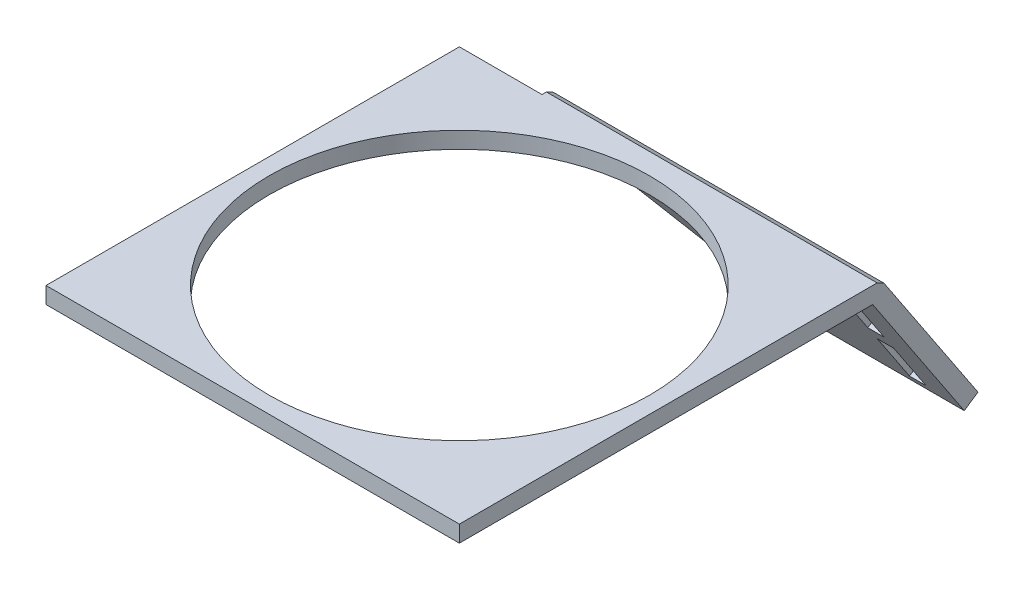
ISO-10303-21;
HEADER;
FILE_DESCRIPTION(('STEP AP214'),'2;1');
FILE_NAME('part.step','',(''),(''),'','','');
FILE_SCHEMA(('AUTOMOTIVE_DESIGN { 1 0 10303 214 1 1 1 1 }'));
ENDSEC;
DATA;
#1=APPLICATION_CONTEXT('core data for automotive mechanical design processes');
#2=APPLICATION_PROTOCOL_DEFINITION('international standard','automotive_design',2000,#1);
#3=PRODUCT_CONTEXT('',#1,'mechanical');
#4=PRODUCT('Part','Part','',(#3));
#5=PRODUCT_RELATED_PRODUCT_CATEGORY('part','',(#4));
#6=PRODUCT_DEFINITION_FORMATION('','',#4);
#7=PRODUCT_DEFINITION_CONTEXT('part definition',#1,'design');
#8=PRODUCT_DEFINITION('design','',#6,#7);
#9=PRODUCT_DEFINITION_SHAPE('','',#8);
#10=(LENGTH_UNIT() NAMED_UNIT(*) SI_UNIT(.MILLI.,.METRE.));
#11=(NAMED_UNIT(*) PLANE_ANGLE_UNIT() SI_UNIT($,.RADIAN.));
#12=(NAMED_UNIT(*) SI_UNIT($,.STERADIAN.) SOLID_ANGLE_UNIT());
#13=UNCERTAINTY_MEASURE_WITH_UNIT(LENGTH_MEASURE(1.E-05),#10,'distance_accuracy_value','');
#14=(GEOMETRIC_REPRESENTATION_CONTEXT(3) GLOBAL_UNCERTAINTY_ASSIGNED_CONTEXT((#13)) GLOBAL_UNIT_ASSIGNED_CONTEXT((#10,
#11,#12)) REPRESENTATION_CONTEXT('',''));
#15=CARTESIAN_POINT('',(0.,0.,0.));
#16=DIRECTION('',(0.,0.,1.));
#17=DIRECTION('',(1.,0.,0.));
#18=AXIS2_PLACEMENT_3D('',#15,#16,#17);
#19=CARTESIAN_POINT('',(-4.,6.43679601982153,-58.9330956874139));
#20=DIRECTION('',(1.,0.,0.));
#21=DIRECTION('',(0.,0.,-1.));
#22=AXIS2_PLACEMENT_3D('',#19,#20,#21);
#23=PLANE('',#22);
#24=DIRECTION('',(0.,0.832717125771484,0.553698644071735));
#25=VECTOR('',#24,1.);
#26=CARTESIAN_POINT('',(-4.,-15.7111497430479,-25.6244106565546));
#27=LINE('',#26,#25);
#28=CARTESIAN_POINT('',(-4.,-15.7111497430479,-25.6244106565546));
#29=VERTEX_POINT('',#28);
#30=CARTESIAN_POINT('',(-4.,-9.84190902614033,-21.7217761050296));
#31=VERTEX_POINT('',#30);
#32=EDGE_CURVE('E56',#29,#31,#27,.T.);
#33=ORIENTED_EDGE('',*,*,#32,.T.);
#34=DIRECTION('',(0.,0.553698644071735,-0.832717125771485));
#35=VECTOR('',#34,1.);
#36=CARTESIAN_POINT('',(-4.,12.3060367367291,-55.030461135889));
#37=LINE('',#36,#35);
#38=CARTESIAN_POINT('',(-4.,-8.73451173799686,-23.3872103565726));
#39=VERTEX_POINT('',#38);
#40=EDGE_CURVE('E255',#31,#39,#37,.T.);
#41=ORIENTED_EDGE('',*,*,#40,.T.);
#42=DIRECTION('',(0.,-0.832717125771484,-0.553698644071735));
#43=VECTOR('',#42,1.);
#44=CARTESIAN_POINT('',(-4.,-8.73451173799686,-23.3872103565726));
#45=LINE('',#44,#43);
#46=CARTESIAN_POINT('',(-4.,-14.6037524549044,-27.2898449080975));
#47=VERTEX_POINT('',#46);
#48=EDGE_CURVE('E212',#39,#47,#45,.T.);
#49=ORIENTED_EDGE('',*,*,#48,.T.);
#50=DIRECTION('',(0.,-0.553698644071735,0.832717125771484));
#51=VECTOR('',#50,1.);
#52=CARTESIAN_POINT('',(-4.,6.43679601982153,-58.9330956874139));
#53=LINE('',#52,#51);
#54=EDGE_CURVE('E269',#47,#29,#53,.T.);
#55=ORIENTED_EDGE('',*,*,#54,.T.);
#56=EDGE_LOOP('',(#33,#41,#49,#55));
#57=FACE_BOUND('',#56,.T.);
#58=ADVANCED_FACE('F33',(#57),#23,.F.);
#59=CARTESIAN_POINT('',(-6.,6.43679601982153,-58.9330956874139));
#60=DIRECTION('',(-1.,0.,0.));
#61=DIRECTION('',(0.,0.,1.));
#62=AXIS2_PLACEMENT_3D('',#59,#60,#61);
#63=PLANE('',#62);
#64=DIRECTION('',(0.,-0.553698644071735,0.832717125771484));
#65=VECTOR('',#64,1.);
#66=CARTESIAN_POINT('',(-6.,6.43679601982153,-58.9330956874139));
#67=LINE('',#66,#65);
#68=CARTESIAN_POINT('',(-6.00000000000001,-14.6037524549044,-27.2898449080975));
#69=VERTEX_POINT('',#68);
#70=CARTESIAN_POINT('',(-6.,-15.7111497430479,-25.6244106565546));
#71=VERTEX_POINT('',#70);
#72=EDGE_CURVE('E272',#69,#71,#67,.T.);
#73=ORIENTED_EDGE('',*,*,#72,.F.);
#74=DIRECTION('',(0.,0.832717125771484,0.553698644071735));
#75=VECTOR('',#74,1.);
#76=CARTESIAN_POINT('',(-6.00000000000001,-8.73451173799686,-23.3872103565726));
#77=LINE('',#76,#75);
#78=CARTESIAN_POINT('',(-6.00000000000001,-8.73451173799686,-23.3872103565726));
#79=VERTEX_POINT('',#78);
#80=EDGE_CURVE('E205',#69,#79,#77,.T.);
#81=ORIENTED_EDGE('',*,*,#80,.T.);
#82=DIRECTION('',(0.,-0.553698644071735,0.832717125771485));
#83=VECTOR('',#82,1.);
#84=CARTESIAN_POINT('',(-6.,12.3060367367291,-55.030461135889));
#85=LINE('',#84,#83);
#86=CARTESIAN_POINT('',(-6.,-9.84190902614033,-21.7217761050296));
#87=VERTEX_POINT('',#86);
#88=EDGE_CURVE('E11',#79,#87,#85,.T.);
#89=ORIENTED_EDGE('',*,*,#88,.T.);
#90=DIRECTION('',(0.,-0.832717125771484,-0.553698644071735));
#91=VECTOR('',#90,1.);
#92=CARTESIAN_POINT('',(-6.,-15.7111497430479,-25.6244106565546));
#93=LINE('',#92,#91);
#94=EDGE_CURVE('E262',#87,#71,#93,.T.);
#95=ORIENTED_EDGE('',*,*,#94,.T.);
#96=EDGE_LOOP('',(#73,#81,#89,#95));
#97=FACE_BOUND('',#96,.T.);
#98=ADVANCED_FACE('F331',(#97),#63,.F.);
#99=CARTESIAN_POINT('',(0.,0.,0.));
#100=DIRECTION('',(0.,1.,0.));
#101=DIRECTION('',(0.,0.,1.));
#102=AXIS2_PLACEMENT_3D('',#99,#100,#101);
#103=PLANE('',#102);
#104=CARTESIAN_POINT('',(-25.,0.,9.82240500305377));
#105=DIRECTION('',(0.,-1.,0.));
#106=DIRECTION('',(0.,0.,-1.));
#107=AXIS2_PLACEMENT_3D('',#104,#105,#106);
#108=CIRCLE('',#107,23.);
#109=CARTESIAN_POINT('',(-25.,0.,-13.1775949969462));
#110=VERTEX_POINT('',#109);
#111=EDGE_CURVE('E189',#110,#110,#108,.T.);
#112=ORIENTED_EDGE('',*,*,#111,.F.);
#113=EDGE_LOOP('',(#112));
#114=FACE_BOUND('',#113,.T.);
#115=DIRECTION('',(1.,0.,0.));
#116=VECTOR('',#115,1.);
#117=CARTESIAN_POINT('',(0.,0.,-15.1775949969462));
#118=LINE('',#117,#116);
#119=CARTESIAN_POINT('',(-50.,0.,-15.1775949969462));
#120=VERTEX_POINT('',#119);
#121=CARTESIAN_POINT('',(-40.,0.,-15.1775949969462));
#122=VERTEX_POINT('',#121);
#123=EDGE_CURVE('E182',#120,#122,#118,.T.);
#124=ORIENTED_EDGE('',*,*,#123,.T.);
#125=DIRECTION('',(-1.,0.,0.));
#126=VECTOR('',#125,1.);
#127=CARTESIAN_POINT('',(-40.,0.,-15.1775949969462));
#128=LINE('',#127,#126);
#129=CARTESIAN_POINT('',(0.,0.,-15.1775949969462));
#130=VERTEX_POINT('',#129);
#131=EDGE_CURVE('E293',#130,#122,#128,.T.);
#132=ORIENTED_EDGE('',*,*,#131,.F.);
#133=DIRECTION('',(0.,0.,-1.));
#134=VECTOR('',#133,1.);
#135=CARTESIAN_POINT('',(0.,0.,-15.1775949969462));
#136=LINE('',#135,#134);
#137=CARTESIAN_POINT('',(0.,0.,34.8224050030538));
#138=VERTEX_POINT('',#137);
#139=EDGE_CURVE('E291',#138,#130,#136,.T.);
#140=ORIENTED_EDGE('',*,*,#139,.F.);
#141=DIRECTION('',(-1.,0.,0.));
#142=VECTOR('',#141,1.);
#143=CARTESIAN_POINT('',(0.,0.,34.8224050030538));
#144=LINE('',#143,#142);
#145=CARTESIAN_POINT('',(-50.,0.,34.8224050030538));
#146=VERTEX_POINT('',#145);
#147=EDGE_CURVE('E173',#138,#146,#144,.T.);
#148=ORIENTED_EDGE('',*,*,#147,.T.);
#149=DIRECTION('',(0.,0.,-1.));
#150=VECTOR('',#149,1.);
#151=CARTESIAN_POINT('',(-50.,0.,-15.1775949969462));
#152=LINE('',#151,#150);
#153=EDGE_CURVE('E186',#146,#120,#152,.T.);
#154=ORIENTED_EDGE('',*,*,#153,.T.);
#155=EDGE_LOOP('',(#124,#132,#140,#148,#154));
#156=FACE_BOUND('',#155,.T.);
#157=ADVANCED_FACE('F336',(#114,#156),#103,.F.);
#158=CARTESIAN_POINT('',(-40.,1.,-15.1775949969462));
#159=DIRECTION('',(1.,0.,0.));
#160=DIRECTION('',(0.,0.,-1.));
#161=AXIS2_PLACEMENT_3D('',#158,#159,#160);
#162=PLANE('',#161);
#163=DIRECTION('',(0.,-0.553698644071735,0.832717125771484));
#164=VECTOR('',#163,1.);
#165=CARTESIAN_POINT('',(-40.,22.1479457628694,-48.4862800278056));
#166=LINE('',#165,#164);
#167=CARTESIAN_POINT('',(-40.,1.10739728814347,-16.8430292484892));
#168=VERTEX_POINT('',#167);
#169=EDGE_CURVE('E281',#168,#122,#166,.T.);
#170=ORIENTED_EDGE('',*,*,#169,.T.);
#171=DIRECTION('',(0.,1.,0.));
#172=VECTOR('',#171,1.);
#173=CARTESIAN_POINT('',(-40.,1.,-15.1775949969462));
#174=LINE('',#173,#172);
#175=CARTESIAN_POINT('',(-40.,2.,-15.1775949969462));
#176=VERTEX_POINT('',#175);
#177=EDGE_CURVE('E48',#122,#176,#174,.T.);
#178=ORIENTED_EDGE('',*,*,#177,.T.);
#179=DIRECTION('',(0.,0.,1.));
#180=VECTOR('',#179,1.);
#181=CARTESIAN_POINT('',(-40.,2.,24.8224050030538));
#182=LINE('',#181,#180);
#183=CARTESIAN_POINT('',(-40.,2.,-15.7135529376632));
#184=VERTEX_POINT('',#183);
#185=EDGE_CURVE('E166',#184,#176,#182,.T.);
#186=ORIENTED_EDGE('',*,*,#185,.F.);
#187=DIRECTION('',(0.,-0.472388270349854,-0.88139056157635));
#188=VECTOR('',#187,1.);
#189=CARTESIAN_POINT('',(-40.,2.,-15.7135529376632));
#190=LINE('',#189,#188);
#191=CARTESIAN_POINT('',(-40.,1.55369864407173,-16.5462700634347));
#192=VERTEX_POINT('',#191);
#193=EDGE_CURVE('E202',#184,#192,#190,.T.);
#194=ORIENTED_EDGE('',*,*,#193,.T.);
#195=DIRECTION('',(0.,0.832717125771486,0.553698644071733));
#196=VECTOR('',#195,1.);
#197=CARTESIAN_POINT('',(-40.,1.55369864407173,-16.5462700634347));
#198=LINE('',#197,#196);
#199=EDGE_CURVE('E242',#168,#192,#198,.T.);
#200=ORIENTED_EDGE('',*,*,#199,.F.);
#201=EDGE_LOOP('',(#170,#178,#186,#194,#200));
#202=FACE_BOUND('',#201,.T.);
#203=ADVANCED_FACE('F35',(#202),#162,.F.);
#204=CARTESIAN_POINT('',(0.,1.,-15.1775949969462));
#205=DIRECTION('',(-1.,0.,0.));
#206=DIRECTION('',(0.,0.,1.));
#207=AXIS2_PLACEMENT_3D('',#204,#205,#206);
#208=PLANE('',#207);
#209=DIRECTION('',(0.,0.472388270349854,0.88139056157635));
#210=VECTOR('',#209,1.);
#211=CARTESIAN_POINT('',(0.,2.,-15.7135529376632));
#212=LINE('',#211,#210);
#213=CARTESIAN_POINT('',(0.,1.55369864407174,-16.5462700634347));
#214=VERTEX_POINT('',#213);
#215=CARTESIAN_POINT('',(0.,2.,-15.7135529376632));
#216=VERTEX_POINT('',#215);
#217=EDGE_CURVE('E161',#214,#216,#212,.T.);
#218=ORIENTED_EDGE('',*,*,#217,.T.);
#219=DIRECTION('',(0.,0.,-1.));
#220=VECTOR('',#219,1.);
#221=CARTESIAN_POINT('',(0.,2.,24.8224050030538));
#222=LINE('',#221,#220);
#223=CARTESIAN_POINT('',(0.,2.,34.8224050030538));
#224=VERTEX_POINT('',#223);
#225=EDGE_CURVE('E154',#224,#216,#222,.T.);
#226=ORIENTED_EDGE('',*,*,#225,.F.);
#227=DIRECTION('',(0.,-1.,0.));
#228=VECTOR('',#227,1.);
#229=CARTESIAN_POINT('',(0.,2.,34.8224050030538));
#230=LINE('',#229,#228);
#231=EDGE_CURVE('E158',#224,#138,#230,.T.);
#232=ORIENTED_EDGE('',*,*,#231,.T.);
#233=ORIENTED_EDGE('',*,*,#139,.T.);
#234=DIRECTION('',(0.,-0.832717125771485,-0.553698644071735));
#235=VECTOR('',#234,1.);
#236=CARTESIAN_POINT('',(0.,0.,-15.1775949969462));
#237=LINE('',#236,#235);
#238=CARTESIAN_POINT('',(0.,-16.6543425154297,-26.2515678783809));
#239=VERTEX_POINT('',#238);
#240=EDGE_CURVE('E283',#130,#239,#237,.T.);
#241=ORIENTED_EDGE('',*,*,#240,.T.);
#242=DIRECTION('',(0.,0.553698644071734,-0.832717125771485));
#243=VECTOR('',#242,1.);
#244=CARTESIAN_POINT('',(0.,-16.6543425154297,-26.2515678783809));
#245=LINE('',#244,#243);
#246=CARTESIAN_POINT('',(0.,-15.5469452272862,-27.9170021299239));
#247=VERTEX_POINT('',#246);
#248=EDGE_CURVE('E287',#239,#247,#245,.T.);
#249=ORIENTED_EDGE('',*,*,#248,.T.);
#250=DIRECTION('',(0.,-0.832717125771484,-0.553698644071735));
#251=VECTOR('',#250,1.);
#252=CARTESIAN_POINT('',(0.,-15.5469452272862,-27.9170021299239));
#253=LINE('',#252,#251);
#254=EDGE_CURVE('E233',#214,#247,#253,.T.);
#255=ORIENTED_EDGE('',*,*,#254,.F.);
#256=EDGE_LOOP('',(#218,#226,#232,#233,#241,#249,#255));
#257=FACE_BOUND('',#256,.T.);
#258=ADVANCED_FACE('F156',(#257),#208,.F.);
#259=CARTESIAN_POINT('',(-40.,-16.6543425154297,-26.2515678783809));
#260=DIRECTION('',(0.,-0.832717125771485,-0.553698644071734));
#261=DIRECTION('',(0.,0.553698644071734,-0.832717125771485));
#262=AXIS2_PLACEMENT_3D('',#259,#260,#261);
#263=PLANE('',#262);
#264=DIRECTION('',(0.,-0.553698644071735,0.832717125771484));
#265=VECTOR('',#264,1.);
#266=CARTESIAN_POINT('',(-20.,5.4936032474397,-59.5602529092403));
#267=LINE('',#266,#265);
#268=CARTESIAN_POINT('',(-20.,-15.5469452272862,-27.9170021299239));
#269=VERTEX_POINT('',#268);
#270=CARTESIAN_POINT('',(-20.,-16.6543425154297,-26.2515678783809));
#271=VERTEX_POINT('',#270);
#272=EDGE_CURVE('E280',#269,#271,#267,.T.);
#273=ORIENTED_EDGE('',*,*,#272,.F.);
#274=DIRECTION('',(-1.,0.,0.));
#275=VECTOR('',#274,1.);
#276=CARTESIAN_POINT('',(-20.,-15.5469452272862,-27.9170021299239));
#277=LINE('',#276,#275);
#278=EDGE_CURVE('E236',#247,#269,#277,.T.);
#279=ORIENTED_EDGE('',*,*,#278,.F.);
#280=ORIENTED_EDGE('',*,*,#248,.F.);
#281=DIRECTION('',(1.,0.,0.));
#282=VECTOR('',#281,1.);
#283=CARTESIAN_POINT('',(-40.,-16.6543425154297,-26.2515678783809));
#284=LINE('',#283,#282);
#285=EDGE_CURVE('E289',#271,#239,#284,.T.);
#286=ORIENTED_EDGE('',*,*,#285,.F.);
#287=EDGE_LOOP('',(#273,#279,#280,#286));
#288=FACE_BOUND('',#287,.T.);
#289=ADVANCED_FACE('F402',(#288),#263,.T.);
#290=CARTESIAN_POINT('',(-40.,0.,-15.1775949969462));
#291=DIRECTION('',(0.,-0.553698644071735,0.832717125771485));
#292=DIRECTION('',(0.,-0.832717125771485,-0.553698644071735));
#293=AXIS2_PLACEMENT_3D('',#290,#291,#292);
#294=PLANE('',#293);
#295=ORIENTED_EDGE('',*,*,#94,.F.);
#296=DIRECTION('',(1.,0.,0.));
#297=VECTOR('',#296,1.);
#298=CARTESIAN_POINT('',(-3.04562725591495,-9.84190902614033,-21.7217761050296));
#299=LINE('',#298,#297);
#300=EDGE_CURVE('E249',#87,#31,#299,.T.);
#301=ORIENTED_EDGE('',*,*,#300,.T.);
#302=ORIENTED_EDGE('',*,*,#32,.F.);
#303=DIRECTION('',(1.,0.,0.));
#304=VECTOR('',#303,1.);
#305=CARTESIAN_POINT('',(-4.,-15.7111497430479,-25.6244106565546));
#306=LINE('',#305,#304);
#307=EDGE_CURVE('E265',#71,#29,#306,.T.);
#308=ORIENTED_EDGE('',*,*,#307,.F.);
#309=EDGE_LOOP('',(#295,#301,#302,#308));
#310=FACE_BOUND('',#309,.T.);
#311=CARTESIAN_POINT('',(-4.,-8.12644295036001,-20.5811111532543));
#312=VERTEX_POINT('',#311);
#313=CARTESIAN_POINT('',(-4.,-0.756216722100785,-15.680426223413));
#314=VERTEX_POINT('',#313);
#315=EDGE_CURVE('E257',#312,#314,#27,.T.);
#316=ORIENTED_EDGE('',*,*,#315,.F.);
#317=DIRECTION('',(-1.,0.,0.));
#318=VECTOR('',#317,1.);
#319=CARTESIAN_POINT('',(-3.04562725591495,-8.12644295036001,-20.5811111532543));
#320=LINE('',#319,#318);
#321=CARTESIAN_POINT('',(-6.,-8.12644295036,-20.5811111532543));
#322=VERTEX_POINT('',#321);
#323=EDGE_CURVE('E246',#312,#322,#320,.T.);
#324=ORIENTED_EDGE('',*,*,#323,.T.);
#325=CARTESIAN_POINT('',(-6.,-0.756216722100783,-15.680426223413));
#326=VERTEX_POINT('',#325);
#327=EDGE_CURVE('E263',#326,#322,#93,.T.);
#328=ORIENTED_EDGE('',*,*,#327,.F.);
#329=DIRECTION('',(-1.,0.,0.));
#330=VECTOR('',#329,1.);
#331=CARTESIAN_POINT('',(-4.,-0.756216722100783,-15.680426223413));
#332=LINE('',#331,#330);
#333=EDGE_CURVE('E259',#314,#326,#332,.T.);
#334=ORIENTED_EDGE('',*,*,#333,.F.);
#335=EDGE_LOOP('',(#316,#324,#328,#334));
#336=FACE_BOUND('',#335,.T.);
#337=DIRECTION('',(-0.707106781186548,0.588819926443188,0.39152406595692));
#338=VECTOR('',#337,1.);
#339=CARTESIAN_POINT('',(-20.,-16.6543425154297,-26.2515678783809));
#340=LINE('',#339,#338);
#341=EDGE_CURVE('E271',#271,#122,#340,.T.);
#342=ORIENTED_EDGE('',*,*,#341,.F.);
#343=ORIENTED_EDGE('',*,*,#285,.T.);
#344=ORIENTED_EDGE('',*,*,#240,.F.);
#345=ORIENTED_EDGE('',*,*,#131,.T.);
#346=EDGE_LOOP('',(#342,#343,#344,#345));
#347=FACE_BOUND('',#346,.T.);
#348=ADVANCED_FACE('F313',(#310,#336,#347),#294,.T.);
#349=CARTESIAN_POINT('',(-20.,5.4936032474397,-59.5602529092403));
#350=DIRECTION('',(0.707106781186547,0.588819926443188,0.39152406595692));
#351=DIRECTION('',(-0.639904898610702,0.768454111013811,0.));
#352=AXIS2_PLACEMENT_3D('',#349,#350,#351);
#353=PLANE('',#352);
#354=ORIENTED_EDGE('',*,*,#169,.F.);
#355=DIRECTION('',(-0.707106781186548,0.588819926443187,0.391524065956921));
#356=VECTOR('',#355,1.);
#357=CARTESIAN_POINT('',(-40.,1.10739728814347,-16.8430292484892));
#358=LINE('',#357,#356);
#359=EDGE_CURVE('E239',#269,#168,#358,.T.);
#360=ORIENTED_EDGE('',*,*,#359,.F.);
#361=ORIENTED_EDGE('',*,*,#272,.T.);
#362=ORIENTED_EDGE('',*,*,#341,.T.);
#363=EDGE_LOOP('',(#354,#360,#361,#362));
#364=FACE_BOUND('',#363,.T.);
#365=ADVANCED_FACE('F319',(#364),#353,.F.);
#366=DIRECTION('',(0.,-0.553698644071735,0.832717125771484));
#367=VECTOR('',#366,1.);
#368=CARTESIAN_POINT('',(-4.,21.3917290407686,-48.9891112542724));
#369=LINE('',#368,#367);
#370=CARTESIAN_POINT('',(-4.,0.351180566042685,-17.345860474956));
#371=VERTEX_POINT('',#370);
#372=EDGE_CURVE('E268',#371,#314,#369,.T.);
#373=ORIENTED_EDGE('',*,*,#372,.F.);
#374=DIRECTION('',(0.,-0.832717125771484,-0.553698644071735));
#375=VECTOR('',#374,1.);
#376=CARTESIAN_POINT('',(-4.,0.351180566042685,-17.345860474956));
#377=LINE('',#376,#375);
#378=CARTESIAN_POINT('',(-4.,-7.01904566221655,-22.2465454047973));
#379=VERTEX_POINT('',#378);
#380=EDGE_CURVE('E224',#371,#379,#377,.T.);
#381=ORIENTED_EDGE('',*,*,#380,.T.);
#382=DIRECTION('',(0.,-0.553698644071735,0.832717125771485));
#383=VECTOR('',#382,1.);
#384=CARTESIAN_POINT('',(-4.,14.0215028125094,-53.8897961841137));
#385=LINE('',#384,#383);
#386=EDGE_CURVE('E252',#379,#312,#385,.T.);
#387=ORIENTED_EDGE('',*,*,#386,.T.);
#388=ORIENTED_EDGE('',*,*,#315,.T.);
#389=EDGE_LOOP('',(#373,#381,#387,#388));
#390=FACE_BOUND('',#389,.T.);
#391=ADVANCED_FACE('F316',(#390),#23,.F.);
#392=CARTESIAN_POINT('',(-4.,6.43679601982153,-58.9330956874139));
#393=DIRECTION('',(0.,-0.832717125771484,-0.553698644071735));
#394=DIRECTION('',(0.,0.553698644071735,-0.832717125771484));
#395=AXIS2_PLACEMENT_3D('',#392,#393,#394);
#396=PLANE('',#395);
#397=ORIENTED_EDGE('',*,*,#54,.F.);
#398=DIRECTION('',(-1.,0.,0.));
#399=VECTOR('',#398,1.);
#400=CARTESIAN_POINT('',(-6.00000000000001,-14.6037524549044,-27.2898449080975));
#401=LINE('',#400,#399);
#402=EDGE_CURVE('E215',#47,#69,#401,.T.);
#403=ORIENTED_EDGE('',*,*,#402,.T.);
#404=ORIENTED_EDGE('',*,*,#72,.T.);
#405=ORIENTED_EDGE('',*,*,#307,.T.);
#406=EDGE_LOOP('',(#397,#403,#404,#405));
#407=FACE_BOUND('',#406,.T.);
#408=ADVANCED_FACE('F318',(#407),#396,.F.);
#409=ORIENTED_EDGE('',*,*,#327,.T.);
#410=DIRECTION('',(0.,0.553698644071735,-0.832717125771485));
#411=VECTOR('',#410,1.);
#412=CARTESIAN_POINT('',(-6.,14.0215028125094,-53.8897961841137));
#413=LINE('',#412,#411);
#414=CARTESIAN_POINT('',(-6.00000000000001,-7.01904566221653,-22.2465454047973));
#415=VERTEX_POINT('',#414);
#416=EDGE_CURVE('E41',#322,#415,#413,.T.);
#417=ORIENTED_EDGE('',*,*,#416,.T.);
#418=DIRECTION('',(0.,0.832717125771484,0.553698644071735));
#419=VECTOR('',#418,1.);
#420=CARTESIAN_POINT('',(-6.00000000000001,0.351180566042685,-17.345860474956));
#421=LINE('',#420,#419);
#422=CARTESIAN_POINT('',(-6.00000000000001,0.351180566042685,-17.345860474956));
#423=VERTEX_POINT('',#422);
#424=EDGE_CURVE('E218',#415,#423,#421,.T.);
#425=ORIENTED_EDGE('',*,*,#424,.T.);
#426=DIRECTION('',(0.,-0.553698644071735,0.832717125771484));
#427=VECTOR('',#426,1.);
#428=CARTESIAN_POINT('',(-6.,21.3917290407686,-48.9891112542724));
#429=LINE('',#428,#427);
#430=EDGE_CURVE('E275',#423,#326,#429,.T.);
#431=ORIENTED_EDGE('',*,*,#430,.T.);
#432=EDGE_LOOP('',(#409,#417,#425,#431));
#433=FACE_BOUND('',#432,.T.);
#434=ADVANCED_FACE('F297',(#433),#63,.F.);
#435=CARTESIAN_POINT('',(-4.,21.3917290407686,-48.9891112542724));
#436=DIRECTION('',(0.,0.832717125771484,0.553698644071735));
#437=DIRECTION('',(0.,-0.553698644071735,0.832717125771484));
#438=AXIS2_PLACEMENT_3D('',#435,#436,#437);
#439=PLANE('',#438);
#440=ORIENTED_EDGE('',*,*,#430,.F.);
#441=DIRECTION('',(1.,0.,0.));
#442=VECTOR('',#441,1.);
#443=CARTESIAN_POINT('',(-6.00000000000001,0.351180566042685,-17.345860474956));
#444=LINE('',#443,#442);
#445=EDGE_CURVE('E221',#423,#371,#444,.T.);
#446=ORIENTED_EDGE('',*,*,#445,.T.);
#447=ORIENTED_EDGE('',*,*,#372,.T.);
#448=ORIENTED_EDGE('',*,*,#333,.T.);
#449=EDGE_LOOP('',(#440,#446,#447,#448));
#450=FACE_BOUND('',#449,.T.);
#451=ADVANCED_FACE('F310',(#450),#439,.F.);
#452=CARTESIAN_POINT('',(-3.04562725591495,-9.28821038206859,-22.5544932308011));
#453=DIRECTION('',(0.,-0.832717125771485,-0.553698644071735));
#454=DIRECTION('',(0.,0.553698644071735,-0.832717125771485));
#455=AXIS2_PLACEMENT_3D('',#452,#453,#454);
#456=PLANE('',#455);
#457=ORIENTED_EDGE('',*,*,#40,.F.);
#458=ORIENTED_EDGE('',*,*,#300,.F.);
#459=ORIENTED_EDGE('',*,*,#88,.F.);
#460=DIRECTION('',(1.,0.,0.));
#461=VECTOR('',#460,1.);
#462=CARTESIAN_POINT('',(-6.00000000000001,-8.73451173799686,-23.3872103565726));
#463=LINE('',#462,#461);
#464=EDGE_CURVE('E209',#79,#39,#463,.T.);
#465=ORIENTED_EDGE('',*,*,#464,.T.);
#466=EDGE_LOOP('',(#457,#458,#459,#465));
#467=FACE_BOUND('',#466,.T.);
#468=ADVANCED_FACE('F348',(#467),#456,.T.);
#469=CARTESIAN_POINT('',(-3.04562725591495,-7.57274430628827,-21.4138282790258));
#470=DIRECTION('',(0.,0.832717125771485,0.553698644071735));
#471=DIRECTION('',(0.,-0.553698644071735,0.832717125771485));
#472=AXIS2_PLACEMENT_3D('',#469,#470,#471);
#473=PLANE('',#472);
#474=ORIENTED_EDGE('',*,*,#386,.F.);
#475=DIRECTION('',(-1.,0.,0.));
#476=VECTOR('',#475,1.);
#477=CARTESIAN_POINT('',(-6.00000000000001,-7.01904566221653,-22.2465454047973));
#478=LINE('',#477,#476);
#479=EDGE_CURVE('E227',#379,#415,#478,.T.);
#480=ORIENTED_EDGE('',*,*,#479,.T.);
#481=ORIENTED_EDGE('',*,*,#416,.F.);
#482=ORIENTED_EDGE('',*,*,#323,.F.);
#483=EDGE_LOOP('',(#474,#480,#481,#482));
#484=FACE_BOUND('',#483,.T.);
#485=ADVANCED_FACE('F304',(#484),#473,.T.);
#486=CARTESIAN_POINT('',(0.,2.,0.));
#487=DIRECTION('',(0.,-1.,0.));
#488=DIRECTION('',(0.,0.,-1.));
#489=AXIS2_PLACEMENT_3D('',#486,#487,#488);
#490=PLANE('',#489);
#491=CARTESIAN_POINT('',(-25.,2.,9.82240500305377));
#492=DIRECTION('',(0.,-1.,0.));
#493=DIRECTION('',(0.,0.,-1.));
#494=AXIS2_PLACEMENT_3D('',#491,#492,#493);
#495=CIRCLE('',#494,23.);
#496=CARTESIAN_POINT('',(-25.,2.,-13.1775949969462));
#497=VERTEX_POINT('',#496);
#498=EDGE_CURVE('E195',#497,#497,#495,.T.);
#499=ORIENTED_EDGE('',*,*,#498,.T.);
#500=EDGE_LOOP('',(#499));
#501=FACE_BOUND('',#500,.T.);
#502=ORIENTED_EDGE('',*,*,#185,.T.);
#503=DIRECTION('',(1.,0.,0.));
#504=VECTOR('',#503,1.);
#505=CARTESIAN_POINT('',(0.,2.,-15.1775949969462));
#506=LINE('',#505,#504);
#507=CARTESIAN_POINT('',(-50.,2.,-15.1775949969462));
#508=VERTEX_POINT('',#507);
#509=EDGE_CURVE('E175',#508,#176,#506,.T.);
#510=ORIENTED_EDGE('',*,*,#509,.F.);
#511=DIRECTION('',(0.,0.,-1.));
#512=VECTOR('',#511,1.);
#513=CARTESIAN_POINT('',(-50.,2.,-15.1775949969462));
#514=LINE('',#513,#512);
#515=CARTESIAN_POINT('',(-50.,2.,34.8224050030538));
#516=VERTEX_POINT('',#515);
#517=EDGE_CURVE('E181',#516,#508,#514,.T.);
#518=ORIENTED_EDGE('',*,*,#517,.F.);
#519=DIRECTION('',(-1.,0.,0.));
#520=VECTOR('',#519,1.);
#521=CARTESIAN_POINT('',(0.,2.,34.8224050030538));
#522=LINE('',#521,#520);
#523=EDGE_CURVE('E171',#224,#516,#522,.T.);
#524=ORIENTED_EDGE('',*,*,#523,.F.);
#525=ORIENTED_EDGE('',*,*,#225,.T.);
#526=DIRECTION('',(-1.,0.,0.));
#527=VECTOR('',#526,1.);
#528=CARTESIAN_POINT('',(-40.,2.,-15.7135529376632));
#529=LINE('',#528,#527);
#530=EDGE_CURVE('E165',#216,#184,#529,.T.);
#531=ORIENTED_EDGE('',*,*,#530,.T.);
#532=EDGE_LOOP('',(#502,#510,#518,#524,#525,#531));
#533=FACE_BOUND('',#532,.T.);
#534=ADVANCED_FACE('F178',(#501,#533),#490,.F.);
#535=CARTESIAN_POINT('',(0.,8.10539693628252,-12.1898489589651));
#536=DIRECTION('',(0.,-0.553698644071733,0.832717125771486));
#537=DIRECTION('',(0.,-0.832717125771486,-0.553698644071733));
#538=AXIS2_PLACEMENT_3D('',#535,#536,#537);
#539=PLANE('',#538);
#540=ORIENTED_EDGE('',*,*,#424,.F.);
#541=ORIENTED_EDGE('',*,*,#479,.F.);
#542=ORIENTED_EDGE('',*,*,#380,.F.);
#543=ORIENTED_EDGE('',*,*,#445,.F.);
#544=EDGE_LOOP('',(#540,#541,#542,#543));
#545=FACE_BOUND('',#544,.T.);
#546=DIRECTION('',(1.,0.,0.));
#547=VECTOR('',#546,1.);
#548=CARTESIAN_POINT('',(0.,1.55369864407174,-16.5462700634347));
#549=LINE('',#548,#547);
#550=EDGE_CURVE('E230',#192,#214,#549,.T.);
#551=ORIENTED_EDGE('',*,*,#550,.T.);
#552=ORIENTED_EDGE('',*,*,#254,.T.);
#553=ORIENTED_EDGE('',*,*,#278,.T.);
#554=ORIENTED_EDGE('',*,*,#359,.T.);
#555=ORIENTED_EDGE('',*,*,#199,.T.);
#556=EDGE_LOOP('',(#551,#552,#553,#554,#555));
#557=FACE_BOUND('',#556,.T.);
#558=ORIENTED_EDGE('',*,*,#80,.F.);
#559=ORIENTED_EDGE('',*,*,#402,.F.);
#560=ORIENTED_EDGE('',*,*,#48,.F.);
#561=ORIENTED_EDGE('',*,*,#464,.F.);
#562=EDGE_LOOP('',(#558,#559,#560,#561));
#563=FACE_BOUND('',#562,.T.);
#564=ADVANCED_FACE('F307',(#545,#557,#563),#539,.F.);
#565=CARTESIAN_POINT('',(-41.301313878952,2.,-15.7135529376632));
#566=DIRECTION('',(0.,0.88139056157635,-0.472388270349854));
#567=DIRECTION('',(0.,0.472388270349854,0.88139056157635));
#568=AXIS2_PLACEMENT_3D('',#565,#566,#567);
#569=PLANE('',#568);
#570=ORIENTED_EDGE('',*,*,#193,.F.);
#571=ORIENTED_EDGE('',*,*,#530,.F.);
#572=ORIENTED_EDGE('',*,*,#217,.F.);
#573=ORIENTED_EDGE('',*,*,#550,.F.);
#574=EDGE_LOOP('',(#570,#571,#572,#573));
#575=FACE_BOUND('',#574,.T.);
#576=ADVANCED_FACE('F364',(#575),#569,.T.);
#577=CARTESIAN_POINT('',(0.,2.,-15.1775949969462));
#578=DIRECTION('',(0.,0.,-1.));
#579=DIRECTION('',(-1.,0.,0.));
#580=AXIS2_PLACEMENT_3D('',#577,#578,#579);
#581=PLANE('',#580);
#582=ORIENTED_EDGE('',*,*,#177,.F.);
#583=ORIENTED_EDGE('',*,*,#123,.F.);
#584=DIRECTION('',(0.,-1.,0.));
#585=VECTOR('',#584,1.);
#586=CARTESIAN_POINT('',(-50.,2.,-15.1775949969462));
#587=LINE('',#586,#585);
#588=EDGE_CURVE('E198',#508,#120,#587,.T.);
#589=ORIENTED_EDGE('',*,*,#588,.F.);
#590=ORIENTED_EDGE('',*,*,#509,.T.);
#591=EDGE_LOOP('',(#582,#583,#589,#590));
#592=FACE_BOUND('',#591,.T.);
#593=ADVANCED_FACE('F367',(#592),#581,.T.);
#594=CARTESIAN_POINT('',(-50.,2.,-15.1775949969462));
#595=DIRECTION('',(-1.,0.,0.));
#596=DIRECTION('',(0.,0.,1.));
#597=AXIS2_PLACEMENT_3D('',#594,#595,#596);
#598=PLANE('',#597);
#599=ORIENTED_EDGE('',*,*,#153,.F.);
#600=DIRECTION('',(0.,-1.,0.));
#601=VECTOR('',#600,1.);
#602=CARTESIAN_POINT('',(-50.,2.,34.8224050030538));
#603=LINE('',#602,#601);
#604=EDGE_CURVE('E174',#516,#146,#603,.T.);
#605=ORIENTED_EDGE('',*,*,#604,.F.);
#606=ORIENTED_EDGE('',*,*,#517,.T.);
#607=ORIENTED_EDGE('',*,*,#588,.T.);
#608=EDGE_LOOP('',(#599,#605,#606,#607));
#609=FACE_BOUND('',#608,.T.);
#610=ADVANCED_FACE('F372',(#609),#598,.T.);
#611=CARTESIAN_POINT('',(0.,2.,34.8224050030538));
#612=DIRECTION('',(0.,0.,1.));
#613=DIRECTION('',(1.,0.,0.));
#614=AXIS2_PLACEMENT_3D('',#611,#612,#613);
#615=PLANE('',#614);
#616=ORIENTED_EDGE('',*,*,#147,.F.);
#617=ORIENTED_EDGE('',*,*,#231,.F.);
#618=ORIENTED_EDGE('',*,*,#523,.T.);
#619=ORIENTED_EDGE('',*,*,#604,.T.);
#620=EDGE_LOOP('',(#616,#617,#618,#619));
#621=FACE_BOUND('',#620,.T.);
#622=ADVANCED_FACE('F170',(#621),#615,.T.);
#623=CARTESIAN_POINT('',(-25.,2.,9.82240500305377));
#624=DIRECTION('',(0.,-1.,0.));
#625=DIRECTION('',(0.,0.,-1.));
#626=AXIS2_PLACEMENT_3D('',#623,#624,#625);
#627=CYLINDRICAL_SURFACE('',#626,23.);
#628=ORIENTED_EDGE('',*,*,#498,.F.);
#629=EDGE_LOOP('',(#628));
#630=FACE_BOUND('',#629,.T.);
#631=ORIENTED_EDGE('',*,*,#111,.T.);
#632=EDGE_LOOP('',(#631));
#633=FACE_BOUND('',#632,.T.);
#634=ADVANCED_FACE('F371',(#630,#633),#627,.F.);
#635=CLOSED_SHELL('',(#58,#98,#157,#203,#258,#289,#348,#365,#391,#408,#434,#451,#468,#485,#534,
#564,#576,#593,#610,#622,#634));
#636=MANIFOLD_SOLID_BREP('B2',#635);
#637=ADVANCED_BREP_SHAPE_REPRESENTATION('',(#18,#636),#14);
#638=SHAPE_DEFINITION_REPRESENTATION(#9,#637);
ENDSEC;
END-ISO-10303-21;
